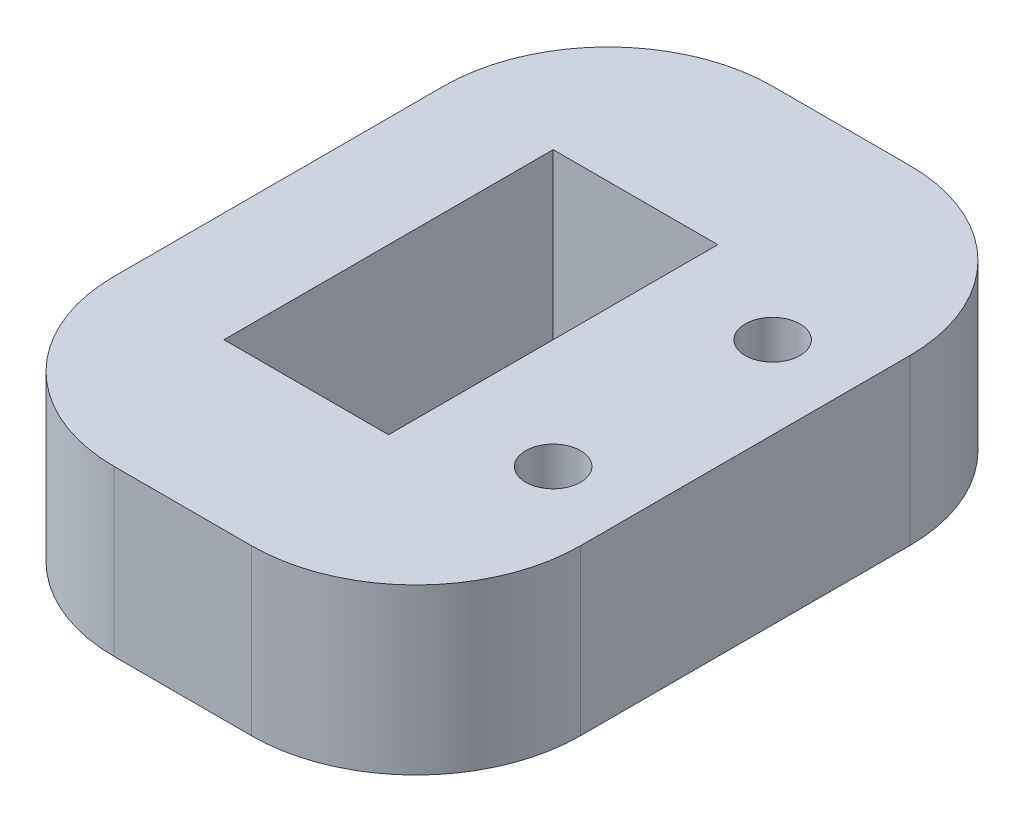
ISO-10303-21;
HEADER;
FILE_DESCRIPTION(('STEP AP214'),'2;1');
FILE_NAME('part.step','',(''),(''),'','','');
FILE_SCHEMA(('AUTOMOTIVE_DESIGN { 1 0 10303 214 1 1 1 1 }'));
ENDSEC;
DATA;
#1=APPLICATION_CONTEXT('core data for automotive mechanical design processes');
#2=APPLICATION_PROTOCOL_DEFINITION('international standard','automotive_design',2000,#1);
#3=PRODUCT_CONTEXT('',#1,'mechanical');
#4=PRODUCT('Part','Part','',(#3));
#5=PRODUCT_RELATED_PRODUCT_CATEGORY('part','',(#4));
#6=PRODUCT_DEFINITION_FORMATION('','',#4);
#7=PRODUCT_DEFINITION_CONTEXT('part definition',#1,'design');
#8=PRODUCT_DEFINITION('design','',#6,#7);
#9=PRODUCT_DEFINITION_SHAPE('','',#8);
#10=(LENGTH_UNIT() NAMED_UNIT(*) SI_UNIT(.MILLI.,.METRE.));
#11=(NAMED_UNIT(*) PLANE_ANGLE_UNIT() SI_UNIT($,.RADIAN.));
#12=(NAMED_UNIT(*) SI_UNIT($,.STERADIAN.) SOLID_ANGLE_UNIT());
#13=UNCERTAINTY_MEASURE_WITH_UNIT(LENGTH_MEASURE(1.E-05),#10,'distance_accuracy_value','');
#14=(GEOMETRIC_REPRESENTATION_CONTEXT(3) GLOBAL_UNCERTAINTY_ASSIGNED_CONTEXT((#13)) GLOBAL_UNIT_ASSIGNED_CONTEXT((#10,
#11,#12)) REPRESENTATION_CONTEXT('',''));
#15=CARTESIAN_POINT('',(0.,0.,0.));
#16=DIRECTION('',(0.,0.,1.));
#17=DIRECTION('',(1.,0.,0.));
#18=AXIS2_PLACEMENT_3D('',#15,#16,#17);
#19=CARTESIAN_POINT('',(0.,1.5,0.));
#20=DIRECTION('',(0.,1.,0.));
#21=DIRECTION('',(0.,0.,1.));
#22=AXIS2_PLACEMENT_3D('',#19,#20,#21);
#23=PLANE('',#22);
#24=CARTESIAN_POINT('',(2.75,1.5,-2.));
#25=DIRECTION('',(0.,1.,0.));
#26=DIRECTION('',(0.,0.,1.));
#27=AXIS2_PLACEMENT_3D('',#24,#25,#26);
#28=CIRCLE('',#27,0.499999999999999);
#29=CARTESIAN_POINT('',(2.75,1.5,-1.5));
#30=VERTEX_POINT('',#29);
#31=EDGE_CURVE('E157',#30,#30,#28,.T.);
#32=ORIENTED_EDGE('',*,*,#31,.F.);
#33=EDGE_LOOP('',(#32));
#34=FACE_BOUND('',#33,.T.);
#35=DIRECTION('',(-1.,0.,0.));
#36=VECTOR('',#35,1.);
#37=CARTESIAN_POINT('',(-4.25,1.5,-6.));
#38=LINE('',#37,#36);
#39=CARTESIAN_POINT('',(1.25,1.5,-6.));
#40=VERTEX_POINT('',#39);
#41=CARTESIAN_POINT('',(-1.25,1.5,-6.));
#42=VERTEX_POINT('',#41);
#43=EDGE_CURVE('E176',#40,#42,#38,.T.);
#44=ORIENTED_EDGE('',*,*,#43,.T.);
#45=CARTESIAN_POINT('',(-1.25,1.5,-3.));
#46=DIRECTION('',(0.,1.,0.));
#47=DIRECTION('',(0.,0.,1.));
#48=AXIS2_PLACEMENT_3D('',#45,#46,#47);
#49=CIRCLE('',#48,3.);
#50=CARTESIAN_POINT('',(-4.25,1.5,-3.));
#51=VERTEX_POINT('',#50);
#52=EDGE_CURVE('E211',#42,#51,#49,.T.);
#53=ORIENTED_EDGE('',*,*,#52,.T.);
#54=DIRECTION('',(0.,0.,1.));
#55=VECTOR('',#54,1.);
#56=CARTESIAN_POINT('',(-4.25,1.5,-6.));
#57=LINE('',#56,#55);
#58=CARTESIAN_POINT('',(-4.25,1.5,3.));
#59=VERTEX_POINT('',#58);
#60=EDGE_CURVE('E168',#51,#59,#57,.T.);
#61=ORIENTED_EDGE('',*,*,#60,.T.);
#62=CARTESIAN_POINT('',(-1.25,1.5,3.));
#63=DIRECTION('',(0.,1.,0.));
#64=DIRECTION('',(0.,0.,1.));
#65=AXIS2_PLACEMENT_3D('',#62,#63,#64);
#66=CIRCLE('',#65,3.);
#67=CARTESIAN_POINT('',(-1.25,1.5,6.));
#68=VERTEX_POINT('',#67);
#69=EDGE_CURVE('E206',#59,#68,#66,.T.);
#70=ORIENTED_EDGE('',*,*,#69,.T.);
#71=DIRECTION('',(1.,0.,0.));
#72=VECTOR('',#71,1.);
#73=CARTESIAN_POINT('',(-4.25,1.5,6.));
#74=LINE('',#73,#72);
#75=CARTESIAN_POINT('',(1.25,1.5,6.));
#76=VERTEX_POINT('',#75);
#77=EDGE_CURVE('E171',#68,#76,#74,.T.);
#78=ORIENTED_EDGE('',*,*,#77,.T.);
#79=CARTESIAN_POINT('',(1.25,1.5,3.));
#80=DIRECTION('',(0.,1.,0.));
#81=DIRECTION('',(0.,0.,1.));
#82=AXIS2_PLACEMENT_3D('',#79,#80,#81);
#83=CIRCLE('',#82,3.);
#84=CARTESIAN_POINT('',(4.25,1.5,3.));
#85=VERTEX_POINT('',#84);
#86=EDGE_CURVE('E55',#76,#85,#83,.T.);
#87=ORIENTED_EDGE('',*,*,#86,.T.);
#88=DIRECTION('',(0.,0.,-1.));
#89=VECTOR('',#88,1.);
#90=CARTESIAN_POINT('',(4.25,1.5,-6.));
#91=LINE('',#90,#89);
#92=CARTESIAN_POINT('',(4.25,1.5,-3.));
#93=VERTEX_POINT('',#92);
#94=EDGE_CURVE('E174',#85,#93,#91,.T.);
#95=ORIENTED_EDGE('',*,*,#94,.T.);
#96=CARTESIAN_POINT('',(1.25,1.5,-3.));
#97=DIRECTION('',(0.,1.,0.));
#98=DIRECTION('',(0.,0.,1.));
#99=AXIS2_PLACEMENT_3D('',#96,#97,#98);
#100=CIRCLE('',#99,3.);
#101=EDGE_CURVE('E209',#93,#40,#100,.T.);
#102=ORIENTED_EDGE('',*,*,#101,.T.);
#103=EDGE_LOOP('',(#44,#53,#61,#70,#78,#87,#95,#102));
#104=FACE_BOUND('',#103,.T.);
#105=DIRECTION('',(1.,0.,0.));
#106=VECTOR('',#105,1.);
#107=CARTESIAN_POINT('',(-2.25,1.5,3.));
#108=LINE('',#107,#106);
#109=CARTESIAN_POINT('',(-2.25,1.5,3.));
#110=VERTEX_POINT('',#109);
#111=CARTESIAN_POINT('',(0.749999999999996,1.5,3.));
#112=VERTEX_POINT('',#111);
#113=EDGE_CURVE('E134',#110,#112,#108,.T.);
#114=ORIENTED_EDGE('',*,*,#113,.F.);
#115=DIRECTION('',(0.,0.,1.));
#116=VECTOR('',#115,1.);
#117=CARTESIAN_POINT('',(-2.25,1.5,-3.));
#118=LINE('',#117,#116);
#119=CARTESIAN_POINT('',(-2.25,1.5,-3.));
#120=VERTEX_POINT('',#119);
#121=EDGE_CURVE('E124',#120,#110,#118,.T.);
#122=ORIENTED_EDGE('',*,*,#121,.F.);
#123=DIRECTION('',(-1.,0.,0.));
#124=VECTOR('',#123,1.);
#125=CARTESIAN_POINT('',(-2.25,1.5,-3.));
#126=LINE('',#125,#124);
#127=CARTESIAN_POINT('',(0.749999999999996,1.5,-3.));
#128=VERTEX_POINT('',#127);
#129=EDGE_CURVE('E150',#128,#120,#126,.T.);
#130=ORIENTED_EDGE('',*,*,#129,.F.);
#131=DIRECTION('',(0.,0.,-1.));
#132=VECTOR('',#131,1.);
#133=CARTESIAN_POINT('',(0.749999999999996,1.5,-3.));
#134=LINE('',#133,#132);
#135=EDGE_CURVE('E148',#112,#128,#134,.T.);
#136=ORIENTED_EDGE('',*,*,#135,.F.);
#137=EDGE_LOOP('',(#114,#122,#130,#136));
#138=FACE_BOUND('',#137,.T.);
#139=CARTESIAN_POINT('',(2.75,1.5,2.));
#140=DIRECTION('',(0.,1.,0.));
#141=DIRECTION('',(0.,0.,1.));
#142=AXIS2_PLACEMENT_3D('',#139,#140,#141);
#143=CIRCLE('',#142,0.499999999999999);
#144=CARTESIAN_POINT('',(2.75,1.5,2.5));
#145=VERTEX_POINT('',#144);
#146=EDGE_CURVE('E395',#145,#145,#143,.T.);
#147=ORIENTED_EDGE('',*,*,#146,.F.);
#148=EDGE_LOOP('',(#147));
#149=FACE_BOUND('',#148,.T.);
#150=ADVANCED_FACE('F33',(#34,#104,#138,#149),#23,.T.);
#151=CARTESIAN_POINT('',(0.,-1.5,0.));
#152=DIRECTION('',(0.,1.,0.));
#153=DIRECTION('',(0.,0.,1.));
#154=AXIS2_PLACEMENT_3D('',#151,#152,#153);
#155=PLANE('',#154);
#156=CARTESIAN_POINT('',(2.75,-1.5,-2.));
#157=DIRECTION('',(0.,1.,0.));
#158=DIRECTION('',(0.,0.,1.));
#159=AXIS2_PLACEMENT_3D('',#156,#157,#158);
#160=CIRCLE('',#159,0.499999999999999);
#161=CARTESIAN_POINT('',(2.75,-1.5,-1.5));
#162=VERTEX_POINT('',#161);
#163=EDGE_CURVE('E398',#162,#162,#160,.T.);
#164=ORIENTED_EDGE('',*,*,#163,.T.);
#165=EDGE_LOOP('',(#164));
#166=FACE_BOUND('',#165,.T.);
#167=DIRECTION('',(0.,0.,1.));
#168=VECTOR('',#167,1.);
#169=CARTESIAN_POINT('',(-4.25,-1.5,-6.));
#170=LINE('',#169,#168);
#171=CARTESIAN_POINT('',(-4.25,-1.5,-3.));
#172=VERTEX_POINT('',#171);
#173=CARTESIAN_POINT('',(-4.25,-1.5,3.));
#174=VERTEX_POINT('',#173);
#175=EDGE_CURVE('E142',#172,#174,#170,.T.);
#176=ORIENTED_EDGE('',*,*,#175,.F.);
#177=CARTESIAN_POINT('',(-1.25,-1.5,-3.));
#178=DIRECTION('',(0.,1.,0.));
#179=DIRECTION('',(0.,0.,1.));
#180=AXIS2_PLACEMENT_3D('',#177,#178,#179);
#181=CIRCLE('',#180,3.);
#182=CARTESIAN_POINT('',(-1.25,-1.5,-6.));
#183=VERTEX_POINT('',#182);
#184=EDGE_CURVE('E199',#172,#183,#181,.F.);
#185=ORIENTED_EDGE('',*,*,#184,.T.);
#186=DIRECTION('',(-1.,0.,0.));
#187=VECTOR('',#186,1.);
#188=CARTESIAN_POINT('',(-4.25,-1.5,-6.));
#189=LINE('',#188,#187);
#190=CARTESIAN_POINT('',(1.25,-1.5,-6.));
#191=VERTEX_POINT('',#190);
#192=EDGE_CURVE('E172',#191,#183,#189,.T.);
#193=ORIENTED_EDGE('',*,*,#192,.F.);
#194=CARTESIAN_POINT('',(1.25,-1.5,-3.));
#195=DIRECTION('',(0.,1.,0.));
#196=DIRECTION('',(0.,0.,1.));
#197=AXIS2_PLACEMENT_3D('',#194,#195,#196);
#198=CIRCLE('',#197,3.);
#199=CARTESIAN_POINT('',(4.25,-1.5,-3.));
#200=VERTEX_POINT('',#199);
#201=EDGE_CURVE('E197',#191,#200,#198,.F.);
#202=ORIENTED_EDGE('',*,*,#201,.T.);
#203=DIRECTION('',(0.,0.,-1.));
#204=VECTOR('',#203,1.);
#205=CARTESIAN_POINT('',(4.25,-1.5,-6.));
#206=LINE('',#205,#204);
#207=CARTESIAN_POINT('',(4.25,-1.5,3.));
#208=VERTEX_POINT('',#207);
#209=EDGE_CURVE('E185',#208,#200,#206,.T.);
#210=ORIENTED_EDGE('',*,*,#209,.F.);
#211=CARTESIAN_POINT('',(1.25,-1.5,3.));
#212=DIRECTION('',(0.,1.,0.));
#213=DIRECTION('',(0.,0.,1.));
#214=AXIS2_PLACEMENT_3D('',#211,#212,#213);
#215=CIRCLE('',#214,3.);
#216=CARTESIAN_POINT('',(1.25,-1.5,6.));
#217=VERTEX_POINT('',#216);
#218=EDGE_CURVE('E195',#208,#217,#215,.F.);
#219=ORIENTED_EDGE('',*,*,#218,.T.);
#220=DIRECTION('',(1.,0.,0.));
#221=VECTOR('',#220,1.);
#222=CARTESIAN_POINT('',(-4.25,-1.5,6.));
#223=LINE('',#222,#221);
#224=CARTESIAN_POINT('',(-1.25,-1.5,6.));
#225=VERTEX_POINT('',#224);
#226=EDGE_CURVE('E182',#225,#217,#223,.T.);
#227=ORIENTED_EDGE('',*,*,#226,.F.);
#228=CARTESIAN_POINT('',(-1.25,-1.5,3.));
#229=DIRECTION('',(0.,1.,0.));
#230=DIRECTION('',(0.,0.,1.));
#231=AXIS2_PLACEMENT_3D('',#228,#229,#230);
#232=CIRCLE('',#231,3.);
#233=EDGE_CURVE('E193',#225,#174,#232,.F.);
#234=ORIENTED_EDGE('',*,*,#233,.T.);
#235=EDGE_LOOP('',(#176,#185,#193,#202,#210,#219,#227,#234));
#236=FACE_BOUND('',#235,.T.);
#237=DIRECTION('',(0.,0.,1.));
#238=VECTOR('',#237,1.);
#239=CARTESIAN_POINT('',(-2.25,-1.5,-3.));
#240=LINE('',#239,#238);
#241=CARTESIAN_POINT('',(-2.25,-1.5,-3.));
#242=VERTEX_POINT('',#241);
#243=CARTESIAN_POINT('',(-2.25,-1.5,3.));
#244=VERTEX_POINT('',#243);
#245=EDGE_CURVE('E155',#242,#244,#240,.T.);
#246=ORIENTED_EDGE('',*,*,#245,.T.);
#247=DIRECTION('',(1.,0.,0.));
#248=VECTOR('',#247,1.);
#249=CARTESIAN_POINT('',(-2.25,-1.5,3.));
#250=LINE('',#249,#248);
#251=CARTESIAN_POINT('',(0.749999999999996,-1.5,3.));
#252=VERTEX_POINT('',#251);
#253=EDGE_CURVE('E141',#244,#252,#250,.T.);
#254=ORIENTED_EDGE('',*,*,#253,.T.);
#255=DIRECTION('',(0.,0.,-1.));
#256=VECTOR('',#255,1.);
#257=CARTESIAN_POINT('',(0.749999999999996,-1.5,-3.));
#258=LINE('',#257,#256);
#259=CARTESIAN_POINT('',(0.749999999999996,-1.5,-3.));
#260=VERTEX_POINT('',#259);
#261=EDGE_CURVE('E159',#252,#260,#258,.T.);
#262=ORIENTED_EDGE('',*,*,#261,.T.);
#263=DIRECTION('',(-1.,0.,0.));
#264=VECTOR('',#263,1.);
#265=CARTESIAN_POINT('',(-2.25,-1.5,-3.));
#266=LINE('',#265,#264);
#267=EDGE_CURVE('E135',#260,#242,#266,.T.);
#268=ORIENTED_EDGE('',*,*,#267,.T.);
#269=EDGE_LOOP('',(#246,#254,#262,#268));
#270=FACE_BOUND('',#269,.T.);
#271=CARTESIAN_POINT('',(2.75,-1.5,2.));
#272=DIRECTION('',(0.,1.,0.));
#273=DIRECTION('',(0.,0.,1.));
#274=AXIS2_PLACEMENT_3D('',#271,#272,#273);
#275=CIRCLE('',#274,0.499999999999999);
#276=CARTESIAN_POINT('',(2.75,-1.5,2.5));
#277=VERTEX_POINT('',#276);
#278=EDGE_CURVE('E393',#277,#277,#275,.T.);
#279=ORIENTED_EDGE('',*,*,#278,.T.);
#280=EDGE_LOOP('',(#279));
#281=FACE_BOUND('',#280,.T.);
#282=ADVANCED_FACE('F227',(#166,#236,#270,#281),#155,.F.);
#283=CARTESIAN_POINT('',(-4.25,1.5,-6.));
#284=DIRECTION('',(1.,0.,0.));
#285=DIRECTION('',(0.,0.,-1.));
#286=AXIS2_PLACEMENT_3D('',#283,#284,#285);
#287=PLANE('',#286);
#288=ORIENTED_EDGE('',*,*,#60,.F.);
#289=DIRECTION('',(0.,-1.,0.));
#290=VECTOR('',#289,1.);
#291=CARTESIAN_POINT('',(-4.25,1.5,-3.));
#292=LINE('',#291,#290);
#293=EDGE_CURVE('E190',#51,#172,#292,.T.);
#294=ORIENTED_EDGE('',*,*,#293,.T.);
#295=ORIENTED_EDGE('',*,*,#175,.T.);
#296=DIRECTION('',(0.,-1.,0.));
#297=VECTOR('',#296,1.);
#298=CARTESIAN_POINT('',(-4.25,1.5,3.));
#299=LINE('',#298,#297);
#300=EDGE_CURVE('E179',#174,#59,#299,.F.);
#301=ORIENTED_EDGE('',*,*,#300,.T.);
#302=EDGE_LOOP('',(#288,#294,#295,#301));
#303=FACE_BOUND('',#302,.T.);
#304=ADVANCED_FACE('F249',(#303),#287,.F.);
#305=CARTESIAN_POINT('',(-4.25,1.5,6.));
#306=DIRECTION('',(0.,0.,-1.));
#307=DIRECTION('',(-1.,0.,0.));
#308=AXIS2_PLACEMENT_3D('',#305,#306,#307);
#309=PLANE('',#308);
#310=ORIENTED_EDGE('',*,*,#226,.T.);
#311=DIRECTION('',(0.,-1.,0.));
#312=VECTOR('',#311,1.);
#313=CARTESIAN_POINT('',(1.25,1.5,6.));
#314=LINE('',#313,#312);
#315=EDGE_CURVE('E11',#217,#76,#314,.F.);
#316=ORIENTED_EDGE('',*,*,#315,.T.);
#317=ORIENTED_EDGE('',*,*,#77,.F.);
#318=DIRECTION('',(0.,-1.,0.));
#319=VECTOR('',#318,1.);
#320=CARTESIAN_POINT('',(-1.25,1.5,6.));
#321=LINE('',#320,#319);
#322=EDGE_CURVE('E41',#68,#225,#321,.T.);
#323=ORIENTED_EDGE('',*,*,#322,.T.);
#324=EDGE_LOOP('',(#310,#316,#317,#323));
#325=FACE_BOUND('',#324,.T.);
#326=ADVANCED_FACE('F221',(#325),#309,.F.);
#327=CARTESIAN_POINT('',(4.25,1.5,-6.));
#328=DIRECTION('',(-1.,0.,0.));
#329=DIRECTION('',(0.,0.,1.));
#330=AXIS2_PLACEMENT_3D('',#327,#328,#329);
#331=PLANE('',#330);
#332=ORIENTED_EDGE('',*,*,#209,.T.);
#333=DIRECTION('',(0.,-1.,0.));
#334=VECTOR('',#333,1.);
#335=CARTESIAN_POINT('',(4.25,1.5,-3.));
#336=LINE('',#335,#334);
#337=EDGE_CURVE('E48',#200,#93,#336,.F.);
#338=ORIENTED_EDGE('',*,*,#337,.T.);
#339=ORIENTED_EDGE('',*,*,#94,.F.);
#340=DIRECTION('',(0.,-1.,0.));
#341=VECTOR('',#340,1.);
#342=CARTESIAN_POINT('',(4.25,1.5,3.));
#343=LINE('',#342,#341);
#344=EDGE_CURVE('E213',#85,#208,#343,.T.);
#345=ORIENTED_EDGE('',*,*,#344,.T.);
#346=EDGE_LOOP('',(#332,#338,#339,#345));
#347=FACE_BOUND('',#346,.T.);
#348=ADVANCED_FACE('F233',(#347),#331,.F.);
#349=CARTESIAN_POINT('',(-4.25,1.5,-6.));
#350=DIRECTION('',(0.,0.,1.));
#351=DIRECTION('',(1.,0.,0.));
#352=AXIS2_PLACEMENT_3D('',#349,#350,#351);
#353=PLANE('',#352);
#354=ORIENTED_EDGE('',*,*,#192,.T.);
#355=DIRECTION('',(0.,-1.,0.));
#356=VECTOR('',#355,1.);
#357=CARTESIAN_POINT('',(-1.25,1.5,-6.));
#358=LINE('',#357,#356);
#359=EDGE_CURVE('E204',#183,#42,#358,.F.);
#360=ORIENTED_EDGE('',*,*,#359,.T.);
#361=ORIENTED_EDGE('',*,*,#43,.F.);
#362=DIRECTION('',(0.,-1.,0.));
#363=VECTOR('',#362,1.);
#364=CARTESIAN_POINT('',(1.25,1.5,-6.));
#365=LINE('',#364,#363);
#366=EDGE_CURVE('E201',#40,#191,#365,.T.);
#367=ORIENTED_EDGE('',*,*,#366,.T.);
#368=EDGE_LOOP('',(#354,#360,#361,#367));
#369=FACE_BOUND('',#368,.T.);
#370=ADVANCED_FACE('F241',(#369),#353,.F.);
#371=CARTESIAN_POINT('',(-2.25,1.5,-3.));
#372=DIRECTION('',(1.,0.,0.));
#373=DIRECTION('',(0.,0.,-1.));
#374=AXIS2_PLACEMENT_3D('',#371,#372,#373);
#375=PLANE('',#374);
#376=ORIENTED_EDGE('',*,*,#245,.F.);
#377=DIRECTION('',(0.,-1.,0.));
#378=VECTOR('',#377,1.);
#379=CARTESIAN_POINT('',(-2.25,1.5,-3.));
#380=LINE('',#379,#378);
#381=EDGE_CURVE('E130',#120,#242,#380,.T.);
#382=ORIENTED_EDGE('',*,*,#381,.F.);
#383=ORIENTED_EDGE('',*,*,#121,.T.);
#384=DIRECTION('',(0.,-1.,0.));
#385=VECTOR('',#384,1.);
#386=CARTESIAN_POINT('',(-2.25,1.5,3.));
#387=LINE('',#386,#385);
#388=EDGE_CURVE('E127',#110,#244,#387,.T.);
#389=ORIENTED_EDGE('',*,*,#388,.T.);
#390=EDGE_LOOP('',(#376,#382,#383,#389));
#391=FACE_BOUND('',#390,.T.);
#392=ADVANCED_FACE('F126',(#391),#375,.T.);
#393=CARTESIAN_POINT('',(-2.25,1.5,3.));
#394=DIRECTION('',(0.,0.,-1.));
#395=DIRECTION('',(-1.,0.,0.));
#396=AXIS2_PLACEMENT_3D('',#393,#394,#395);
#397=PLANE('',#396);
#398=ORIENTED_EDGE('',*,*,#253,.F.);
#399=ORIENTED_EDGE('',*,*,#388,.F.);
#400=ORIENTED_EDGE('',*,*,#113,.T.);
#401=DIRECTION('',(0.,-1.,0.));
#402=VECTOR('',#401,1.);
#403=CARTESIAN_POINT('',(0.749999999999996,1.5,3.));
#404=LINE('',#403,#402);
#405=EDGE_CURVE('E143',#112,#252,#404,.T.);
#406=ORIENTED_EDGE('',*,*,#405,.T.);
#407=EDGE_LOOP('',(#398,#399,#400,#406));
#408=FACE_BOUND('',#407,.T.);
#409=ADVANCED_FACE('F138',(#408),#397,.T.);
#410=CARTESIAN_POINT('',(0.749999999999996,1.5,-3.));
#411=DIRECTION('',(-1.,0.,0.));
#412=DIRECTION('',(0.,0.,1.));
#413=AXIS2_PLACEMENT_3D('',#410,#411,#412);
#414=PLANE('',#413);
#415=ORIENTED_EDGE('',*,*,#261,.F.);
#416=ORIENTED_EDGE('',*,*,#405,.F.);
#417=ORIENTED_EDGE('',*,*,#135,.T.);
#418=DIRECTION('',(0.,-1.,0.));
#419=VECTOR('',#418,1.);
#420=CARTESIAN_POINT('',(0.749999999999996,1.5,-3.));
#421=LINE('',#420,#419);
#422=EDGE_CURVE('E165',#128,#260,#421,.T.);
#423=ORIENTED_EDGE('',*,*,#422,.T.);
#424=EDGE_LOOP('',(#415,#416,#417,#423));
#425=FACE_BOUND('',#424,.T.);
#426=ADVANCED_FACE('F326',(#425),#414,.T.);
#427=CARTESIAN_POINT('',(-2.25,1.5,-3.));
#428=DIRECTION('',(0.,0.,1.));
#429=DIRECTION('',(1.,0.,0.));
#430=AXIS2_PLACEMENT_3D('',#427,#428,#429);
#431=PLANE('',#430);
#432=ORIENTED_EDGE('',*,*,#267,.F.);
#433=ORIENTED_EDGE('',*,*,#422,.F.);
#434=ORIENTED_EDGE('',*,*,#129,.T.);
#435=ORIENTED_EDGE('',*,*,#381,.T.);
#436=EDGE_LOOP('',(#432,#433,#434,#435));
#437=FACE_BOUND('',#436,.T.);
#438=ADVANCED_FACE('F317',(#437),#431,.T.);
#439=CARTESIAN_POINT('',(2.75,1.5,-2.));
#440=DIRECTION('',(0.,-1.,0.));
#441=DIRECTION('',(0.,0.,-1.));
#442=AXIS2_PLACEMENT_3D('',#439,#440,#441);
#443=CYLINDRICAL_SURFACE('',#442,0.499999999999999);
#444=ORIENTED_EDGE('',*,*,#31,.T.);
#445=EDGE_LOOP('',(#444));
#446=FACE_BOUND('',#445,.T.);
#447=ORIENTED_EDGE('',*,*,#163,.F.);
#448=EDGE_LOOP('',(#447));
#449=FACE_BOUND('',#448,.T.);
#450=ADVANCED_FACE('F308',(#446,#449),#443,.F.);
#451=CARTESIAN_POINT('',(2.75,1.5,2.));
#452=DIRECTION('',(0.,-1.,0.));
#453=DIRECTION('',(0.,0.,-1.));
#454=AXIS2_PLACEMENT_3D('',#451,#452,#453);
#455=CYLINDRICAL_SURFACE('',#454,0.499999999999999);
#456=ORIENTED_EDGE('',*,*,#146,.T.);
#457=EDGE_LOOP('',(#456));
#458=FACE_BOUND('',#457,.T.);
#459=ORIENTED_EDGE('',*,*,#278,.F.);
#460=EDGE_LOOP('',(#459));
#461=FACE_BOUND('',#460,.T.);
#462=ADVANCED_FACE('F277',(#458,#461),#455,.F.);
#463=CARTESIAN_POINT('',(-1.25,1.5,-3.));
#464=DIRECTION('',(0.,-1.,0.));
#465=DIRECTION('',(0.,0.,-1.));
#466=AXIS2_PLACEMENT_3D('',#463,#464,#465);
#467=CYLINDRICAL_SURFACE('',#466,3.);
#468=ORIENTED_EDGE('',*,*,#52,.F.);
#469=ORIENTED_EDGE('',*,*,#359,.F.);
#470=ORIENTED_EDGE('',*,*,#184,.F.);
#471=ORIENTED_EDGE('',*,*,#293,.F.);
#472=EDGE_LOOP('',(#468,#469,#470,#471));
#473=FACE_BOUND('',#472,.T.);
#474=ADVANCED_FACE('F246',(#473),#467,.T.);
#475=CARTESIAN_POINT('',(1.25,1.5,-3.));
#476=DIRECTION('',(0.,-1.,0.));
#477=DIRECTION('',(0.,0.,-1.));
#478=AXIS2_PLACEMENT_3D('',#475,#476,#477);
#479=CYLINDRICAL_SURFACE('',#478,3.);
#480=ORIENTED_EDGE('',*,*,#101,.F.);
#481=ORIENTED_EDGE('',*,*,#337,.F.);
#482=ORIENTED_EDGE('',*,*,#201,.F.);
#483=ORIENTED_EDGE('',*,*,#366,.F.);
#484=EDGE_LOOP('',(#480,#481,#482,#483));
#485=FACE_BOUND('',#484,.T.);
#486=ADVANCED_FACE('F238',(#485),#479,.T.);
#487=CARTESIAN_POINT('',(1.25,1.5,3.));
#488=DIRECTION('',(0.,-1.,0.));
#489=DIRECTION('',(0.,0.,-1.));
#490=AXIS2_PLACEMENT_3D('',#487,#488,#489);
#491=CYLINDRICAL_SURFACE('',#490,3.);
#492=ORIENTED_EDGE('',*,*,#86,.F.);
#493=ORIENTED_EDGE('',*,*,#315,.F.);
#494=ORIENTED_EDGE('',*,*,#218,.F.);
#495=ORIENTED_EDGE('',*,*,#344,.F.);
#496=EDGE_LOOP('',(#492,#493,#494,#495));
#497=FACE_BOUND('',#496,.T.);
#498=ADVANCED_FACE('F232',(#497),#491,.T.);
#499=CARTESIAN_POINT('',(-1.25,1.5,3.));
#500=DIRECTION('',(0.,-1.,0.));
#501=DIRECTION('',(0.,0.,-1.));
#502=AXIS2_PLACEMENT_3D('',#499,#500,#501);
#503=CYLINDRICAL_SURFACE('',#502,3.);
#504=ORIENTED_EDGE('',*,*,#69,.F.);
#505=ORIENTED_EDGE('',*,*,#300,.F.);
#506=ORIENTED_EDGE('',*,*,#233,.F.);
#507=ORIENTED_EDGE('',*,*,#322,.F.);
#508=EDGE_LOOP('',(#504,#505,#506,#507));
#509=FACE_BOUND('',#508,.T.);
#510=ADVANCED_FACE('F35',(#509),#503,.T.);
#511=CLOSED_SHELL('',(#150,#282,#304,#326,#348,#370,#392,#409,#426,#438,#450,#462,#474,#486,
#498,#510));
#512=MANIFOLD_SOLID_BREP('B2',#511);
#513=ADVANCED_BREP_SHAPE_REPRESENTATION('',(#18,#512),#14);
#514=SHAPE_DEFINITION_REPRESENTATION(#9,#513);
ENDSEC;
END-ISO-10303-21;
